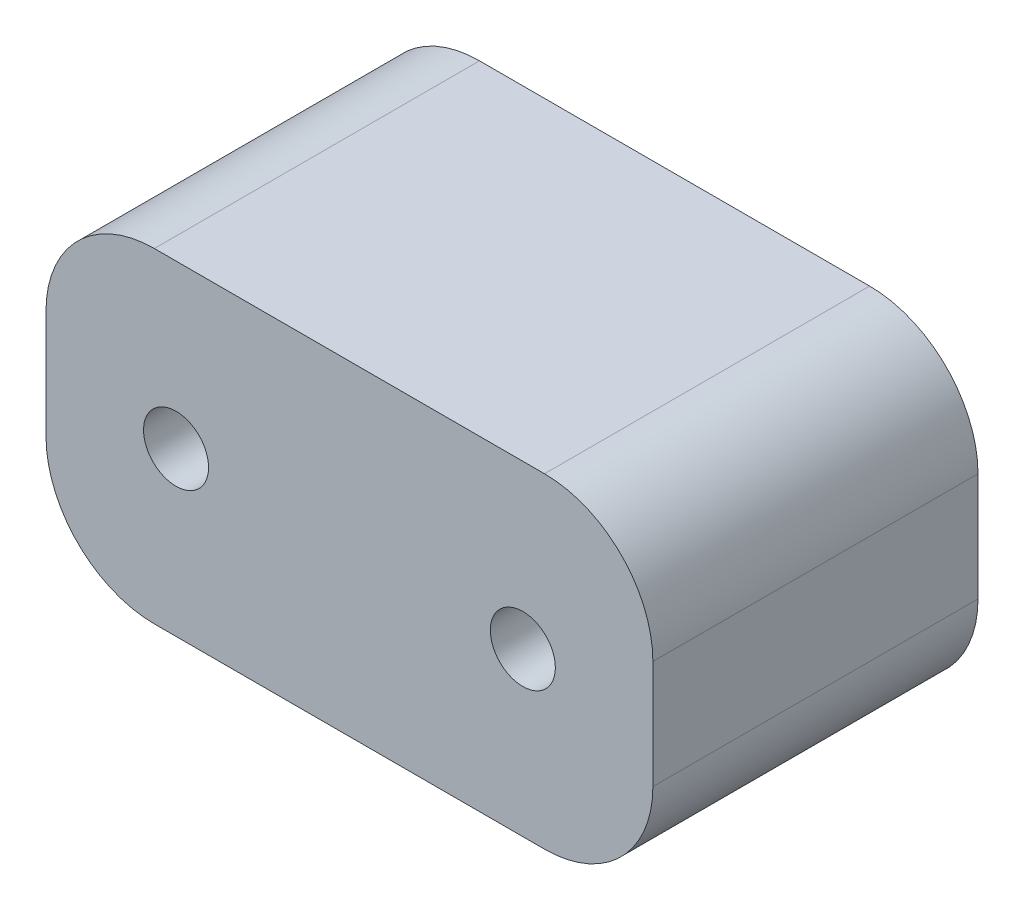
ISO-10303-21;
HEADER;
FILE_DESCRIPTION(('STEP AP214'),'2;1');
FILE_NAME('part.step','',(''),(''),'','','');
FILE_SCHEMA(('AUTOMOTIVE_DESIGN { 1 0 10303 214 1 1 1 1 }'));
ENDSEC;
DATA;
#1=APPLICATION_CONTEXT('core data for automotive mechanical design processes');
#2=APPLICATION_PROTOCOL_DEFINITION('international standard','automotive_design',2000,#1);
#3=PRODUCT_CONTEXT('',#1,'mechanical');
#4=PRODUCT('Part','Part','',(#3));
#5=PRODUCT_RELATED_PRODUCT_CATEGORY('part','',(#4));
#6=PRODUCT_DEFINITION_FORMATION('','',#4);
#7=PRODUCT_DEFINITION_CONTEXT('part definition',#1,'design');
#8=PRODUCT_DEFINITION('design','',#6,#7);
#9=PRODUCT_DEFINITION_SHAPE('','',#8);
#10=(LENGTH_UNIT() NAMED_UNIT(*) SI_UNIT(.MILLI.,.METRE.));
#11=(NAMED_UNIT(*) PLANE_ANGLE_UNIT() SI_UNIT($,.RADIAN.));
#12=(NAMED_UNIT(*) SI_UNIT($,.STERADIAN.) SOLID_ANGLE_UNIT());
#13=UNCERTAINTY_MEASURE_WITH_UNIT(LENGTH_MEASURE(1.E-05),#10,'distance_accuracy_value','');
#14=(GEOMETRIC_REPRESENTATION_CONTEXT(3) GLOBAL_UNCERTAINTY_ASSIGNED_CONTEXT((#13)) GLOBAL_UNIT_ASSIGNED_CONTEXT((#10,
#11,#12)) REPRESENTATION_CONTEXT('',''));
#15=CARTESIAN_POINT('',(0.,0.,0.));
#16=DIRECTION('',(0.,0.,1.));
#17=DIRECTION('',(1.,0.,0.));
#18=AXIS2_PLACEMENT_3D('',#15,#16,#17);
#19=CARTESIAN_POINT('',(0.,0.,15.));
#20=DIRECTION('',(0.,0.,-1.));
#21=DIRECTION('',(-1.,0.,0.));
#22=AXIS2_PLACEMENT_3D('',#19,#20,#21);
#23=PLANE('',#22);
#24=DIRECTION('',(-1.,0.,0.));
#25=VECTOR('',#24,1.);
#26=CARTESIAN_POINT('',(-14.,7.5,15.));
#27=LINE('',#26,#25);
#28=CARTESIAN_POINT('',(9.,7.5,15.));
#29=VERTEX_POINT('',#28);
#30=CARTESIAN_POINT('',(-9.,7.5,15.));
#31=VERTEX_POINT('',#30);
#32=EDGE_CURVE('E168',#29,#31,#27,.T.);
#33=ORIENTED_EDGE('',*,*,#32,.T.);
#34=CARTESIAN_POINT('',(-9.,2.5,15.));
#35=DIRECTION('',(0.,0.,-1.));
#36=DIRECTION('',(-1.,0.,0.));
#37=AXIS2_PLACEMENT_3D('',#34,#35,#36);
#38=CIRCLE('',#37,5.);
#39=CARTESIAN_POINT('',(-14.,2.5,15.));
#40=VERTEX_POINT('',#39);
#41=EDGE_CURVE('E149',#31,#40,#38,.F.);
#42=ORIENTED_EDGE('',*,*,#41,.T.);
#43=DIRECTION('',(0.,-1.,0.));
#44=VECTOR('',#43,1.);
#45=CARTESIAN_POINT('',(-14.,-7.5,15.));
#46=LINE('',#45,#44);
#47=CARTESIAN_POINT('',(-14.,-2.5,15.));
#48=VERTEX_POINT('',#47);
#49=EDGE_CURVE('E119',#40,#48,#46,.T.);
#50=ORIENTED_EDGE('',*,*,#49,.T.);
#51=CARTESIAN_POINT('',(-9.,-2.5,15.));
#52=DIRECTION('',(0.,0.,-1.));
#53=DIRECTION('',(-1.,0.,0.));
#54=AXIS2_PLACEMENT_3D('',#51,#52,#53);
#55=CIRCLE('',#54,5.);
#56=CARTESIAN_POINT('',(-9.,-7.5,15.));
#57=VERTEX_POINT('',#56);
#58=EDGE_CURVE('E55',#48,#57,#55,.F.);
#59=ORIENTED_EDGE('',*,*,#58,.T.);
#60=DIRECTION('',(1.,0.,0.));
#61=VECTOR('',#60,1.);
#62=CARTESIAN_POINT('',(-14.,-7.5,15.));
#63=LINE('',#62,#61);
#64=CARTESIAN_POINT('',(9.,-7.5,15.));
#65=VERTEX_POINT('',#64);
#66=EDGE_CURVE('E135',#57,#65,#63,.T.);
#67=ORIENTED_EDGE('',*,*,#66,.T.);
#68=CARTESIAN_POINT('',(9.,-2.5,15.));
#69=DIRECTION('',(0.,0.,-1.));
#70=DIRECTION('',(-1.,0.,0.));
#71=AXIS2_PLACEMENT_3D('',#68,#69,#70);
#72=CIRCLE('',#71,5.);
#73=CARTESIAN_POINT('',(14.,-2.5,15.));
#74=VERTEX_POINT('',#73);
#75=EDGE_CURVE('E146',#65,#74,#72,.F.);
#76=ORIENTED_EDGE('',*,*,#75,.T.);
#77=DIRECTION('',(0.,1.,0.));
#78=VECTOR('',#77,1.);
#79=CARTESIAN_POINT('',(14.,-7.5,15.));
#80=LINE('',#79,#78);
#81=CARTESIAN_POINT('',(14.,2.5,15.));
#82=VERTEX_POINT('',#81);
#83=EDGE_CURVE('E129',#74,#82,#80,.T.);
#84=ORIENTED_EDGE('',*,*,#83,.T.);
#85=CARTESIAN_POINT('',(9.,2.5,15.));
#86=DIRECTION('',(0.,0.,-1.));
#87=DIRECTION('',(-1.,0.,0.));
#88=AXIS2_PLACEMENT_3D('',#85,#86,#87);
#89=CIRCLE('',#88,5.);
#90=EDGE_CURVE('E144',#82,#29,#89,.F.);
#91=ORIENTED_EDGE('',*,*,#90,.T.);
#92=EDGE_LOOP('',(#33,#42,#50,#59,#67,#76,#84,#91));
#93=FACE_BOUND('',#92,.T.);
#94=CARTESIAN_POINT('',(-8.,0.,15.));
#95=DIRECTION('',(0.,0.,1.));
#96=DIRECTION('',(1.,0.,0.));
#97=AXIS2_PLACEMENT_3D('',#94,#95,#96);
#98=CIRCLE('',#97,1.5);
#99=CARTESIAN_POINT('',(-6.5,0.,15.));
#100=VERTEX_POINT('',#99);
#101=EDGE_CURVE('E173',#100,#100,#98,.T.);
#102=ORIENTED_EDGE('',*,*,#101,.F.);
#103=EDGE_LOOP('',(#102));
#104=FACE_BOUND('',#103,.T.);
#105=CARTESIAN_POINT('',(8.,0.,15.));
#106=DIRECTION('',(0.,0.,1.));
#107=DIRECTION('',(1.,0.,0.));
#108=AXIS2_PLACEMENT_3D('',#105,#106,#107);
#109=CIRCLE('',#108,1.5);
#110=CARTESIAN_POINT('',(9.5,0.,15.));
#111=VERTEX_POINT('',#110);
#112=EDGE_CURVE('E182',#111,#111,#109,.T.);
#113=ORIENTED_EDGE('',*,*,#112,.F.);
#114=EDGE_LOOP('',(#113));
#115=FACE_BOUND('',#114,.T.);
#116=ADVANCED_FACE('F33',(#93,#104,#115),#23,.F.);
#117=CARTESIAN_POINT('',(0.,0.,0.));
#118=DIRECTION('',(0.,0.,-1.));
#119=DIRECTION('',(-1.,0.,0.));
#120=AXIS2_PLACEMENT_3D('',#117,#118,#119);
#121=PLANE('',#120);
#122=CARTESIAN_POINT('',(-8.,0.,0.));
#123=DIRECTION('',(0.,0.,1.));
#124=DIRECTION('',(1.,0.,0.));
#125=AXIS2_PLACEMENT_3D('',#122,#123,#124);
#126=CIRCLE('',#125,1.5);
#127=CARTESIAN_POINT('',(-6.5,0.,0.));
#128=VERTEX_POINT('',#127);
#129=EDGE_CURVE('E175',#128,#128,#126,.T.);
#130=ORIENTED_EDGE('',*,*,#129,.T.);
#131=EDGE_LOOP('',(#130));
#132=FACE_BOUND('',#131,.T.);
#133=DIRECTION('',(0.,-1.,0.));
#134=VECTOR('',#133,1.);
#135=CARTESIAN_POINT('',(-14.,-7.5,0.));
#136=LINE('',#135,#134);
#137=CARTESIAN_POINT('',(-14.,2.5,0.));
#138=VERTEX_POINT('',#137);
#139=CARTESIAN_POINT('',(-14.,-2.5,0.));
#140=VERTEX_POINT('',#139);
#141=EDGE_CURVE('E117',#138,#140,#136,.T.);
#142=ORIENTED_EDGE('',*,*,#141,.F.);
#143=CARTESIAN_POINT('',(-9.,2.5,0.));
#144=DIRECTION('',(0.,0.,-1.));
#145=DIRECTION('',(-1.,0.,0.));
#146=AXIS2_PLACEMENT_3D('',#143,#144,#145);
#147=CIRCLE('',#146,5.);
#148=CARTESIAN_POINT('',(-9.,7.5,0.));
#149=VERTEX_POINT('',#148);
#150=EDGE_CURVE('E100',#138,#149,#147,.T.);
#151=ORIENTED_EDGE('',*,*,#150,.T.);
#152=DIRECTION('',(-1.,0.,0.));
#153=VECTOR('',#152,1.);
#154=CARTESIAN_POINT('',(-14.,7.5,0.));
#155=LINE('',#154,#153);
#156=CARTESIAN_POINT('',(9.,7.5,0.));
#157=VERTEX_POINT('',#156);
#158=EDGE_CURVE('E127',#157,#149,#155,.T.);
#159=ORIENTED_EDGE('',*,*,#158,.F.);
#160=CARTESIAN_POINT('',(9.,2.5,0.));
#161=DIRECTION('',(0.,0.,-1.));
#162=DIRECTION('',(-1.,0.,0.));
#163=AXIS2_PLACEMENT_3D('',#160,#161,#162);
#164=CIRCLE('',#163,5.);
#165=CARTESIAN_POINT('',(14.,2.5,0.));
#166=VERTEX_POINT('',#165);
#167=EDGE_CURVE('E120',#157,#166,#164,.T.);
#168=ORIENTED_EDGE('',*,*,#167,.T.);
#169=DIRECTION('',(0.,1.,0.));
#170=VECTOR('',#169,1.);
#171=CARTESIAN_POINT('',(14.,-7.5,0.));
#172=LINE('',#171,#170);
#173=CARTESIAN_POINT('',(14.,-2.5,0.));
#174=VERTEX_POINT('',#173);
#175=EDGE_CURVE('E131',#174,#166,#172,.T.);
#176=ORIENTED_EDGE('',*,*,#175,.F.);
#177=CARTESIAN_POINT('',(9.,-2.5,0.));
#178=DIRECTION('',(0.,0.,-1.));
#179=DIRECTION('',(-1.,0.,0.));
#180=AXIS2_PLACEMENT_3D('',#177,#178,#179);
#181=CIRCLE('',#180,5.);
#182=CARTESIAN_POINT('',(9.,-7.5,0.));
#183=VERTEX_POINT('',#182);
#184=EDGE_CURVE('E138',#174,#183,#181,.T.);
#185=ORIENTED_EDGE('',*,*,#184,.T.);
#186=DIRECTION('',(1.,0.,0.));
#187=VECTOR('',#186,1.);
#188=CARTESIAN_POINT('',(-14.,-7.5,0.));
#189=LINE('',#188,#187);
#190=CARTESIAN_POINT('',(-9.,-7.5,0.));
#191=VERTEX_POINT('',#190);
#192=EDGE_CURVE('E126',#191,#183,#189,.T.);
#193=ORIENTED_EDGE('',*,*,#192,.F.);
#194=CARTESIAN_POINT('',(-9.,-2.5,0.));
#195=DIRECTION('',(0.,0.,-1.));
#196=DIRECTION('',(-1.,0.,0.));
#197=AXIS2_PLACEMENT_3D('',#194,#195,#196);
#198=CIRCLE('',#197,5.);
#199=EDGE_CURVE('E111',#191,#140,#198,.T.);
#200=ORIENTED_EDGE('',*,*,#199,.T.);
#201=EDGE_LOOP('',(#142,#151,#159,#168,#176,#185,#193,#200));
#202=FACE_BOUND('',#201,.T.);
#203=CARTESIAN_POINT('',(8.,0.,0.));
#204=DIRECTION('',(0.,0.,1.));
#205=DIRECTION('',(1.,0.,0.));
#206=AXIS2_PLACEMENT_3D('',#203,#204,#205);
#207=CIRCLE('',#206,1.5);
#208=CARTESIAN_POINT('',(9.5,0.,0.));
#209=VERTEX_POINT('',#208);
#210=EDGE_CURVE('E184',#209,#209,#207,.T.);
#211=ORIENTED_EDGE('',*,*,#210,.T.);
#212=EDGE_LOOP('',(#211));
#213=FACE_BOUND('',#212,.T.);
#214=ADVANCED_FACE('F123',(#132,#202,#213),#121,.T.);
#215=CARTESIAN_POINT('',(14.,-7.5,15.));
#216=DIRECTION('',(-1.,0.,0.));
#217=DIRECTION('',(0.,0.,1.));
#218=AXIS2_PLACEMENT_3D('',#215,#216,#217);
#219=PLANE('',#218);
#220=ORIENTED_EDGE('',*,*,#83,.F.);
#221=DIRECTION('',(0.,0.,-1.));
#222=VECTOR('',#221,1.);
#223=CARTESIAN_POINT('',(14.,-2.5,15.));
#224=LINE('',#223,#222);
#225=EDGE_CURVE('E11',#74,#174,#224,.T.);
#226=ORIENTED_EDGE('',*,*,#225,.T.);
#227=ORIENTED_EDGE('',*,*,#175,.T.);
#228=DIRECTION('',(0.,0.,-1.));
#229=VECTOR('',#228,1.);
#230=CARTESIAN_POINT('',(14.,2.5,15.));
#231=LINE('',#230,#229);
#232=EDGE_CURVE('E41',#166,#82,#231,.F.);
#233=ORIENTED_EDGE('',*,*,#232,.T.);
#234=EDGE_LOOP('',(#220,#226,#227,#233));
#235=FACE_BOUND('',#234,.T.);
#236=ADVANCED_FACE('F159',(#235),#219,.F.);
#237=CARTESIAN_POINT('',(-14.,7.5,15.));
#238=DIRECTION('',(0.,-1.,0.));
#239=DIRECTION('',(1.,0.,0.));
#240=AXIS2_PLACEMENT_3D('',#237,#238,#239);
#241=PLANE('',#240);
#242=ORIENTED_EDGE('',*,*,#158,.T.);
#243=DIRECTION('',(0.,0.,-1.));
#244=VECTOR('',#243,1.);
#245=CARTESIAN_POINT('',(-9.,7.5,15.));
#246=LINE('',#245,#244);
#247=EDGE_CURVE('E105',#149,#31,#246,.F.);
#248=ORIENTED_EDGE('',*,*,#247,.T.);
#249=ORIENTED_EDGE('',*,*,#32,.F.);
#250=DIRECTION('',(0.,0.,-1.));
#251=VECTOR('',#250,1.);
#252=CARTESIAN_POINT('',(9.,7.5,15.));
#253=LINE('',#252,#251);
#254=EDGE_CURVE('E110',#29,#157,#253,.T.);
#255=ORIENTED_EDGE('',*,*,#254,.T.);
#256=EDGE_LOOP('',(#242,#248,#249,#255));
#257=FACE_BOUND('',#256,.T.);
#258=ADVANCED_FACE('F172',(#257),#241,.F.);
#259=CARTESIAN_POINT('',(-14.,-7.5,15.));
#260=DIRECTION('',(1.,0.,0.));
#261=DIRECTION('',(0.,0.,-1.));
#262=AXIS2_PLACEMENT_3D('',#259,#260,#261);
#263=PLANE('',#262);
#264=ORIENTED_EDGE('',*,*,#49,.F.);
#265=DIRECTION('',(0.,0.,-1.));
#266=VECTOR('',#265,1.);
#267=CARTESIAN_POINT('',(-14.,2.5,15.));
#268=LINE('',#267,#266);
#269=EDGE_CURVE('E104',#40,#138,#268,.T.);
#270=ORIENTED_EDGE('',*,*,#269,.T.);
#271=ORIENTED_EDGE('',*,*,#141,.T.);
#272=DIRECTION('',(0.,0.,-1.));
#273=VECTOR('',#272,1.);
#274=CARTESIAN_POINT('',(-14.,-2.5,15.));
#275=LINE('',#274,#273);
#276=EDGE_CURVE('E121',#140,#48,#275,.F.);
#277=ORIENTED_EDGE('',*,*,#276,.T.);
#278=EDGE_LOOP('',(#264,#270,#271,#277));
#279=FACE_BOUND('',#278,.T.);
#280=ADVANCED_FACE('F116',(#279),#263,.F.);
#281=CARTESIAN_POINT('',(-14.,-7.5,15.));
#282=DIRECTION('',(0.,1.,0.));
#283=DIRECTION('',(0.,0.,1.));
#284=AXIS2_PLACEMENT_3D('',#281,#282,#283);
#285=PLANE('',#284);
#286=ORIENTED_EDGE('',*,*,#66,.F.);
#287=DIRECTION('',(0.,0.,-1.));
#288=VECTOR('',#287,1.);
#289=CARTESIAN_POINT('',(-9.,-7.5,15.));
#290=LINE('',#289,#288);
#291=EDGE_CURVE('E152',#57,#191,#290,.T.);
#292=ORIENTED_EDGE('',*,*,#291,.T.);
#293=ORIENTED_EDGE('',*,*,#192,.T.);
#294=DIRECTION('',(0.,0.,-1.));
#295=VECTOR('',#294,1.);
#296=CARTESIAN_POINT('',(9.,-7.5,15.));
#297=LINE('',#296,#295);
#298=EDGE_CURVE('E48',#183,#65,#297,.F.);
#299=ORIENTED_EDGE('',*,*,#298,.T.);
#300=EDGE_LOOP('',(#286,#292,#293,#299));
#301=FACE_BOUND('',#300,.T.);
#302=ADVANCED_FACE('F205',(#301),#285,.F.);
#303=CARTESIAN_POINT('',(-8.,0.,15.));
#304=DIRECTION('',(0.,0.,-1.));
#305=DIRECTION('',(-1.,0.,0.));
#306=AXIS2_PLACEMENT_3D('',#303,#304,#305);
#307=CYLINDRICAL_SURFACE('',#306,1.5);
#308=ORIENTED_EDGE('',*,*,#101,.T.);
#309=EDGE_LOOP('',(#308));
#310=FACE_BOUND('',#309,.T.);
#311=ORIENTED_EDGE('',*,*,#129,.F.);
#312=EDGE_LOOP('',(#311));
#313=FACE_BOUND('',#312,.T.);
#314=ADVANCED_FACE('F202',(#310,#313),#307,.F.);
#315=CARTESIAN_POINT('',(8.,0.,15.));
#316=DIRECTION('',(0.,0.,-1.));
#317=DIRECTION('',(-1.,0.,0.));
#318=AXIS2_PLACEMENT_3D('',#315,#316,#317);
#319=CYLINDRICAL_SURFACE('',#318,1.5);
#320=ORIENTED_EDGE('',*,*,#112,.T.);
#321=EDGE_LOOP('',(#320));
#322=FACE_BOUND('',#321,.T.);
#323=ORIENTED_EDGE('',*,*,#210,.F.);
#324=EDGE_LOOP('',(#323));
#325=FACE_BOUND('',#324,.T.);
#326=ADVANCED_FACE('F190',(#322,#325),#319,.F.);
#327=CARTESIAN_POINT('',(-9.,2.5,15.));
#328=DIRECTION('',(0.,0.,-1.));
#329=DIRECTION('',(-1.,0.,0.));
#330=AXIS2_PLACEMENT_3D('',#327,#328,#329);
#331=CYLINDRICAL_SURFACE('',#330,5.);
#332=ORIENTED_EDGE('',*,*,#41,.F.);
#333=ORIENTED_EDGE('',*,*,#247,.F.);
#334=ORIENTED_EDGE('',*,*,#150,.F.);
#335=ORIENTED_EDGE('',*,*,#269,.F.);
#336=EDGE_LOOP('',(#332,#333,#334,#335));
#337=FACE_BOUND('',#336,.T.);
#338=ADVANCED_FACE('F103',(#337),#331,.T.);
#339=CARTESIAN_POINT('',(-9.,-2.5,15.));
#340=DIRECTION('',(0.,0.,-1.));
#341=DIRECTION('',(-1.,0.,0.));
#342=AXIS2_PLACEMENT_3D('',#339,#340,#341);
#343=CYLINDRICAL_SURFACE('',#342,5.);
#344=ORIENTED_EDGE('',*,*,#58,.F.);
#345=ORIENTED_EDGE('',*,*,#276,.F.);
#346=ORIENTED_EDGE('',*,*,#199,.F.);
#347=ORIENTED_EDGE('',*,*,#291,.F.);
#348=EDGE_LOOP('',(#344,#345,#346,#347));
#349=FACE_BOUND('',#348,.T.);
#350=ADVANCED_FACE('F216',(#349),#343,.T.);
#351=CARTESIAN_POINT('',(9.,-2.5,15.));
#352=DIRECTION('',(0.,0.,-1.));
#353=DIRECTION('',(-1.,0.,0.));
#354=AXIS2_PLACEMENT_3D('',#351,#352,#353);
#355=CYLINDRICAL_SURFACE('',#354,5.);
#356=ORIENTED_EDGE('',*,*,#75,.F.);
#357=ORIENTED_EDGE('',*,*,#298,.F.);
#358=ORIENTED_EDGE('',*,*,#184,.F.);
#359=ORIENTED_EDGE('',*,*,#225,.F.);
#360=EDGE_LOOP('',(#356,#357,#358,#359));
#361=FACE_BOUND('',#360,.T.);
#362=ADVANCED_FACE('F218',(#361),#355,.T.);
#363=CARTESIAN_POINT('',(9.,2.5,15.));
#364=DIRECTION('',(0.,0.,-1.));
#365=DIRECTION('',(-1.,0.,0.));
#366=AXIS2_PLACEMENT_3D('',#363,#364,#365);
#367=CYLINDRICAL_SURFACE('',#366,5.);
#368=ORIENTED_EDGE('',*,*,#90,.F.);
#369=ORIENTED_EDGE('',*,*,#232,.F.);
#370=ORIENTED_EDGE('',*,*,#167,.F.);
#371=ORIENTED_EDGE('',*,*,#254,.F.);
#372=EDGE_LOOP('',(#368,#369,#370,#371));
#373=FACE_BOUND('',#372,.T.);
#374=ADVANCED_FACE('F35',(#373),#367,.T.);
#375=CLOSED_SHELL('',(#116,#214,#236,#258,#280,#302,#314,#326,#338,#350,#362,#374));
#376=MANIFOLD_SOLID_BREP('B2',#375);
#377=ADVANCED_BREP_SHAPE_REPRESENTATION('',(#18,#376),#14);
#378=SHAPE_DEFINITION_REPRESENTATION(#9,#377);
ENDSEC;
END-ISO-10303-21;
